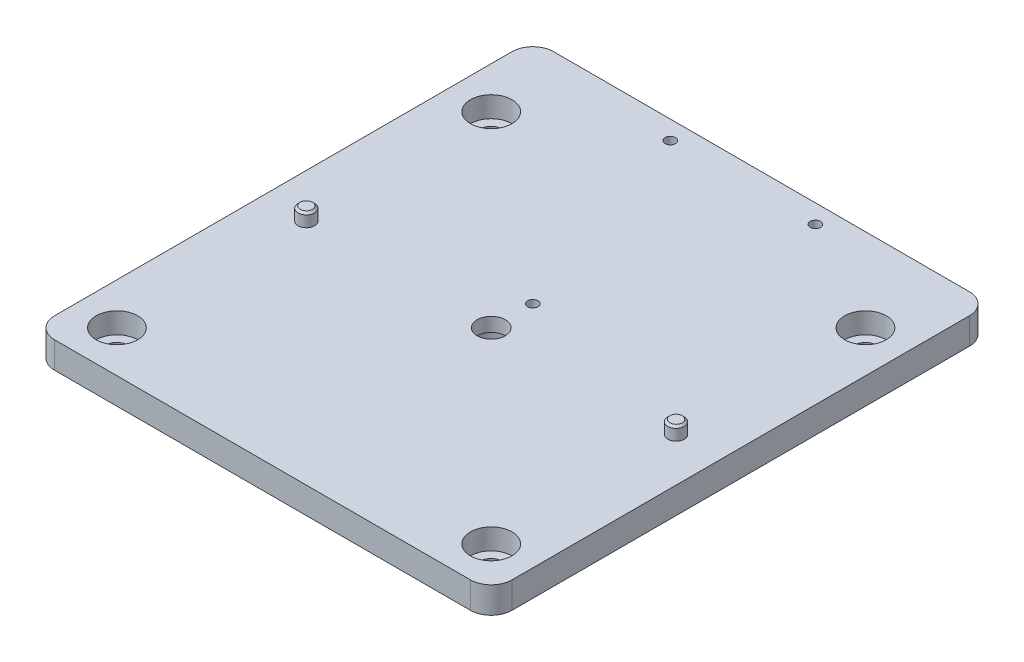
ISO-10303-21;
HEADER;
FILE_DESCRIPTION(('STEP AP214'),'2;1');
FILE_NAME('part.step','',(''),(''),'','','');
FILE_SCHEMA(('AUTOMOTIVE_DESIGN { 1 0 10303 214 1 1 1 1 }'));
ENDSEC;
DATA;
#1=APPLICATION_CONTEXT('core data for automotive mechanical design processes');
#2=APPLICATION_PROTOCOL_DEFINITION('international standard','automotive_design',2000,#1);
#3=PRODUCT_CONTEXT('',#1,'mechanical');
#4=PRODUCT('Part','Part','',(#3));
#5=PRODUCT_RELATED_PRODUCT_CATEGORY('part','',(#4));
#6=PRODUCT_DEFINITION_FORMATION('','',#4);
#7=PRODUCT_DEFINITION_CONTEXT('part definition',#1,'design');
#8=PRODUCT_DEFINITION('design','',#6,#7);
#9=PRODUCT_DEFINITION_SHAPE('','',#8);
#10=(LENGTH_UNIT() NAMED_UNIT(*) SI_UNIT(.MILLI.,.METRE.));
#11=(NAMED_UNIT(*) PLANE_ANGLE_UNIT() SI_UNIT($,.RADIAN.));
#12=(NAMED_UNIT(*) SI_UNIT($,.STERADIAN.) SOLID_ANGLE_UNIT());
#13=UNCERTAINTY_MEASURE_WITH_UNIT(LENGTH_MEASURE(1.E-05),#10,'distance_accuracy_value','');
#14=(GEOMETRIC_REPRESENTATION_CONTEXT(3) GLOBAL_UNCERTAINTY_ASSIGNED_CONTEXT((#13)) GLOBAL_UNIT_ASSIGNED_CONTEXT((#10,
#11,#12)) REPRESENTATION_CONTEXT('',''));
#15=CARTESIAN_POINT('',(0.,0.,0.));
#16=DIRECTION('',(0.,0.,1.));
#17=DIRECTION('',(1.,0.,0.));
#18=AXIS2_PLACEMENT_3D('',#15,#16,#17);
#19=CARTESIAN_POINT('',(-44.45,9.525,0.));
#20=DIRECTION('',(0.,-1.,0.));
#21=DIRECTION('',(0.,0.,-1.));
#22=AXIS2_PLACEMENT_3D('',#19,#20,#21);
#23=CYLINDRICAL_SURFACE('',#22,1.984375);
#24=CARTESIAN_POINT('',(-44.45,0.500000000000006,0.));
#25=DIRECTION('',(0.,1.,0.));
#26=DIRECTION('',(0.,0.,1.));
#27=AXIS2_PLACEMENT_3D('',#24,#25,#26);
#28=CIRCLE('',#27,1.984375);
#29=CARTESIAN_POINT('',(-44.45,0.500000000000006,1.98437500000001));
#30=VERTEX_POINT('',#29);
#31=EDGE_CURVE('E62',#30,#30,#28,.T.);
#32=ORIENTED_EDGE('',*,*,#31,.T.);
#33=EDGE_LOOP('',(#32));
#34=FACE_BOUND('',#33,.T.);
#35=CARTESIAN_POINT('',(-44.45,9.025,0.));
#36=DIRECTION('',(0.,1.,0.));
#37=DIRECTION('',(0.,0.,1.));
#38=AXIS2_PLACEMENT_3D('',#35,#36,#37);
#39=CIRCLE('',#38,1.984375);
#40=CARTESIAN_POINT('',(-44.45,9.025,1.98437500000001));
#41=VERTEX_POINT('',#40);
#42=EDGE_CURVE('E66',#41,#41,#39,.F.);
#43=ORIENTED_EDGE('',*,*,#42,.T.);
#44=EDGE_LOOP('',(#43));
#45=FACE_BOUND('',#44,.T.);
#46=ADVANCED_FACE('F51',(#34,#45),#23,.T.);
#47=CARTESIAN_POINT('',(-44.45,9.525,0.));
#48=DIRECTION('',(0.,1.,0.));
#49=DIRECTION('',(0.,0.,1.));
#50=AXIS2_PLACEMENT_3D('',#47,#48,#49);
#51=PLANE('',#50);
#52=CARTESIAN_POINT('',(-44.45,9.525,0.));
#53=DIRECTION('',(0.,1.,0.));
#54=DIRECTION('',(0.,0.,1.));
#55=AXIS2_PLACEMENT_3D('',#52,#53,#54);
#56=CIRCLE('',#55,1.484375);
#57=CARTESIAN_POINT('',(-44.45,9.525,1.48437500000001));
#58=VERTEX_POINT('',#57);
#59=EDGE_CURVE('E11',#58,#58,#56,.T.);
#60=ORIENTED_EDGE('',*,*,#59,.T.);
#61=EDGE_LOOP('',(#60));
#62=FACE_BOUND('',#61,.T.);
#63=ADVANCED_FACE('F82',(#62),#51,.T.);
#64=CARTESIAN_POINT('',(-44.45,0.,0.));
#65=DIRECTION('',(0.,1.,0.));
#66=DIRECTION('',(0.,0.,1.));
#67=AXIS2_PLACEMENT_3D('',#64,#65,#66);
#68=PLANE('',#67);
#69=CARTESIAN_POINT('',(-44.45,0.,0.));
#70=DIRECTION('',(0.,1.,0.));
#71=DIRECTION('',(0.,0.,1.));
#72=AXIS2_PLACEMENT_3D('',#69,#70,#71);
#73=CIRCLE('',#72,1.48437499999999);
#74=CARTESIAN_POINT('',(-44.45,0.,1.484375));
#75=VERTEX_POINT('',#74);
#76=EDGE_CURVE('E58',#75,#75,#73,.F.);
#77=ORIENTED_EDGE('',*,*,#76,.T.);
#78=EDGE_LOOP('',(#77));
#79=FACE_BOUND('',#78,.T.);
#80=ADVANCED_FACE('F79',(#79),#68,.F.);
#81=CARTESIAN_POINT('',(-44.45,0.500000000000006,0.));
#82=DIRECTION('',(0.,1.,0.));
#83=DIRECTION('',(0.,0.,1.));
#84=AXIS2_PLACEMENT_3D('',#81,#82,#83);
#85=CONICAL_SURFACE('',#84,1.984375,0.785398163397449);
#86=ORIENTED_EDGE('',*,*,#76,.F.);
#87=EDGE_LOOP('',(#86));
#88=FACE_BOUND('',#87,.T.);
#89=ORIENTED_EDGE('',*,*,#31,.F.);
#90=EDGE_LOOP('',(#89));
#91=FACE_BOUND('',#90,.T.);
#92=ADVANCED_FACE('F75',(#88,#91),#85,.T.);
#93=CARTESIAN_POINT('',(-44.45,9.525,0.));
#94=DIRECTION('',(0.,-1.,0.));
#95=DIRECTION('',(0.,0.,-1.));
#96=AXIS2_PLACEMENT_3D('',#93,#94,#95);
#97=CONICAL_SURFACE('',#96,1.484375,0.785398163397446);
#98=ORIENTED_EDGE('',*,*,#42,.F.);
#99=EDGE_LOOP('',(#98));
#100=FACE_BOUND('',#99,.T.);
#101=ORIENTED_EDGE('',*,*,#59,.F.);
#102=EDGE_LOOP('',(#101));
#103=FACE_BOUND('',#102,.T.);
#104=ADVANCED_FACE('F53',(#100,#103),#97,.T.);
#105=CLOSED_SHELL('',(#46,#63,#80,#92,#104));
#106=MANIFOLD_SOLID_BREP('B2',#105);
#107=CARTESIAN_POINT('',(44.45,9.525,0.));
#108=DIRECTION('',(0.,-1.,0.));
#109=DIRECTION('',(0.,0.,-1.));
#110=AXIS2_PLACEMENT_3D('',#107,#108,#109);
#111=CYLINDRICAL_SURFACE('',#110,1.984375);
#112=CARTESIAN_POINT('',(44.45,0.500000000000006,0.));
#113=DIRECTION('',(0.,1.,0.));
#114=DIRECTION('',(0.,0.,1.));
#115=AXIS2_PLACEMENT_3D('',#112,#113,#114);
#116=CIRCLE('',#115,1.984375);
#117=CARTESIAN_POINT('',(44.45,0.500000000000006,1.984375));
#118=VERTEX_POINT('',#117);
#119=EDGE_CURVE('E141',#118,#118,#116,.T.);
#120=ORIENTED_EDGE('',*,*,#119,.T.);
#121=EDGE_LOOP('',(#120));
#122=FACE_BOUND('',#121,.T.);
#123=CARTESIAN_POINT('',(44.45,9.025,0.));
#124=DIRECTION('',(0.,1.,0.));
#125=DIRECTION('',(0.,0.,1.));
#126=AXIS2_PLACEMENT_3D('',#123,#124,#125);
#127=CIRCLE('',#126,1.984375);
#128=CARTESIAN_POINT('',(44.45,9.025,1.984375));
#129=VERTEX_POINT('',#128);
#130=EDGE_CURVE('E145',#129,#129,#127,.F.);
#131=ORIENTED_EDGE('',*,*,#130,.T.);
#132=EDGE_LOOP('',(#131));
#133=FACE_BOUND('',#132,.T.);
#134=ADVANCED_FACE('F130',(#122,#133),#111,.T.);
#135=CARTESIAN_POINT('',(44.45,9.525,0.));
#136=DIRECTION('',(0.,1.,0.));
#137=DIRECTION('',(0.,0.,1.));
#138=AXIS2_PLACEMENT_3D('',#135,#136,#137);
#139=PLANE('',#138);
#140=CARTESIAN_POINT('',(44.45,9.525,0.));
#141=DIRECTION('',(0.,1.,0.));
#142=DIRECTION('',(0.,0.,1.));
#143=AXIS2_PLACEMENT_3D('',#140,#141,#142);
#144=CIRCLE('',#143,1.484375);
#145=CARTESIAN_POINT('',(44.45,9.525,1.484375));
#146=VERTEX_POINT('',#145);
#147=EDGE_CURVE('E50',#146,#146,#144,.T.);
#148=ORIENTED_EDGE('',*,*,#147,.T.);
#149=EDGE_LOOP('',(#148));
#150=FACE_BOUND('',#149,.T.);
#151=ADVANCED_FACE('F161',(#150),#139,.T.);
#152=CARTESIAN_POINT('',(44.45,0.,0.));
#153=DIRECTION('',(0.,1.,0.));
#154=DIRECTION('',(0.,0.,1.));
#155=AXIS2_PLACEMENT_3D('',#152,#153,#154);
#156=PLANE('',#155);
#157=CARTESIAN_POINT('',(44.45,0.,0.));
#158=DIRECTION('',(0.,1.,0.));
#159=DIRECTION('',(0.,0.,1.));
#160=AXIS2_PLACEMENT_3D('',#157,#158,#159);
#161=CIRCLE('',#160,1.48437499999999);
#162=CARTESIAN_POINT('',(44.45,0.,1.48437499999999));
#163=VERTEX_POINT('',#162);
#164=EDGE_CURVE('E137',#163,#163,#161,.F.);
#165=ORIENTED_EDGE('',*,*,#164,.T.);
#166=EDGE_LOOP('',(#165));
#167=FACE_BOUND('',#166,.T.);
#168=ADVANCED_FACE('F158',(#167),#156,.F.);
#169=CARTESIAN_POINT('',(44.45,0.500000000000006,0.));
#170=DIRECTION('',(0.,1.,0.));
#171=DIRECTION('',(0.,0.,1.));
#172=AXIS2_PLACEMENT_3D('',#169,#170,#171);
#173=CONICAL_SURFACE('',#172,1.984375,0.785398163397449);
#174=ORIENTED_EDGE('',*,*,#164,.F.);
#175=EDGE_LOOP('',(#174));
#176=FACE_BOUND('',#175,.T.);
#177=ORIENTED_EDGE('',*,*,#119,.F.);
#178=EDGE_LOOP('',(#177));
#179=FACE_BOUND('',#178,.T.);
#180=ADVANCED_FACE('F154',(#176,#179),#173,.T.);
#181=CARTESIAN_POINT('',(44.45,9.525,0.));
#182=DIRECTION('',(0.,-1.,0.));
#183=DIRECTION('',(0.,0.,-1.));
#184=AXIS2_PLACEMENT_3D('',#181,#182,#183);
#185=CONICAL_SURFACE('',#184,1.484375,0.785398163397446);
#186=ORIENTED_EDGE('',*,*,#130,.F.);
#187=EDGE_LOOP('',(#186));
#188=FACE_BOUND('',#187,.T.);
#189=ORIENTED_EDGE('',*,*,#147,.F.);
#190=EDGE_LOOP('',(#189));
#191=FACE_BOUND('',#190,.T.);
#192=ADVANCED_FACE('F132',(#188,#191),#185,.T.);
#193=CLOSED_SHELL('',(#134,#151,#168,#180,#192));
#194=MANIFOLD_SOLID_BREP('B6',#193);
#195=CARTESIAN_POINT('',(-50.,6.35,50.));
#196=DIRECTION('',(0.,-1.,0.));
#197=DIRECTION('',(0.,0.,-1.));
#198=AXIS2_PLACEMENT_3D('',#195,#196,#197);
#199=CYLINDRICAL_SURFACE('',#198,5.);
#200=CARTESIAN_POINT('',(-50.,0.,50.));
#201=DIRECTION('',(0.,1.,0.));
#202=DIRECTION('',(0.,0.,1.));
#203=AXIS2_PLACEMENT_3D('',#200,#201,#202);
#204=CIRCLE('',#203,5.);
#205=CARTESIAN_POINT('',(-55.,0.,50.));
#206=VERTEX_POINT('',#205);
#207=CARTESIAN_POINT('',(-50.,0.,55.));
#208=VERTEX_POINT('',#207);
#209=EDGE_CURVE('E293',#206,#208,#204,.T.);
#210=ORIENTED_EDGE('',*,*,#209,.T.);
#211=DIRECTION('',(0.,-1.,0.));
#212=VECTOR('',#211,1.);
#213=CARTESIAN_POINT('',(-50.,6.35,55.));
#214=LINE('',#213,#212);
#215=CARTESIAN_POINT('',(-50.,6.35,55.));
#216=VERTEX_POINT('',#215);
#217=EDGE_CURVE('E272',#216,#208,#214,.T.);
#218=ORIENTED_EDGE('',*,*,#217,.F.);
#219=CARTESIAN_POINT('',(-50.,6.35,50.));
#220=DIRECTION('',(0.,1.,0.));
#221=DIRECTION('',(0.,0.,1.));
#222=AXIS2_PLACEMENT_3D('',#219,#220,#221);
#223=CIRCLE('',#222,5.);
#224=CARTESIAN_POINT('',(-55.,6.35,50.));
#225=VERTEX_POINT('',#224);
#226=EDGE_CURVE('E280',#225,#216,#223,.T.);
#227=ORIENTED_EDGE('',*,*,#226,.F.);
#228=DIRECTION('',(0.,-1.,0.));
#229=VECTOR('',#228,1.);
#230=CARTESIAN_POINT('',(-55.,6.35,50.));
#231=LINE('',#230,#229);
#232=EDGE_CURVE('E349',#225,#206,#231,.T.);
#233=ORIENTED_EDGE('',*,*,#232,.T.);
#234=EDGE_LOOP('',(#210,#218,#227,#233));
#235=FACE_BOUND('',#234,.T.);
#236=ADVANCED_FACE('F200',(#235),#199,.T.);
#237=CARTESIAN_POINT('',(-50.,6.35,55.));
#238=DIRECTION('',(0.,0.,-1.));
#239=DIRECTION('',(-1.,0.,0.));
#240=AXIS2_PLACEMENT_3D('',#237,#238,#239);
#241=PLANE('',#240);
#242=DIRECTION('',(1.,0.,0.));
#243=VECTOR('',#242,1.);
#244=CARTESIAN_POINT('',(-50.,0.,55.));
#245=LINE('',#244,#243);
#246=CARTESIAN_POINT('',(50.,0.,55.));
#247=VERTEX_POINT('',#246);
#248=EDGE_CURVE('E358',#208,#247,#245,.T.);
#249=ORIENTED_EDGE('',*,*,#248,.T.);
#250=DIRECTION('',(0.,-1.,0.));
#251=VECTOR('',#250,1.);
#252=CARTESIAN_POINT('',(50.,6.35,55.));
#253=LINE('',#252,#251);
#254=CARTESIAN_POINT('',(50.,6.35,55.));
#255=VERTEX_POINT('',#254);
#256=EDGE_CURVE('E275',#255,#247,#253,.T.);
#257=ORIENTED_EDGE('',*,*,#256,.F.);
#258=DIRECTION('',(1.,0.,0.));
#259=VECTOR('',#258,1.);
#260=CARTESIAN_POINT('',(-50.,6.35,55.));
#261=LINE('',#260,#259);
#262=EDGE_CURVE('E268',#216,#255,#261,.T.);
#263=ORIENTED_EDGE('',*,*,#262,.F.);
#264=ORIENTED_EDGE('',*,*,#217,.T.);
#265=EDGE_LOOP('',(#249,#257,#263,#264));
#266=FACE_BOUND('',#265,.T.);
#267=ADVANCED_FACE('F270',(#266),#241,.F.);
#268=CARTESIAN_POINT('',(50.,6.35,50.));
#269=DIRECTION('',(0.,-1.,0.));
#270=DIRECTION('',(0.,0.,-1.));
#271=AXIS2_PLACEMENT_3D('',#268,#269,#270);
#272=CYLINDRICAL_SURFACE('',#271,5.);
#273=CARTESIAN_POINT('',(50.,0.,50.));
#274=DIRECTION('',(0.,1.,0.));
#275=DIRECTION('',(0.,0.,1.));
#276=AXIS2_PLACEMENT_3D('',#273,#274,#275);
#277=CIRCLE('',#276,5.);
#278=CARTESIAN_POINT('',(55.,0.,50.));
#279=VERTEX_POINT('',#278);
#280=EDGE_CURVE('E362',#247,#279,#277,.T.);
#281=ORIENTED_EDGE('',*,*,#280,.T.);
#282=DIRECTION('',(0.,-1.,0.));
#283=VECTOR('',#282,1.);
#284=CARTESIAN_POINT('',(55.,6.35,50.));
#285=LINE('',#284,#283);
#286=CARTESIAN_POINT('',(55.,6.35,50.));
#287=VERTEX_POINT('',#286);
#288=EDGE_CURVE('E302',#287,#279,#285,.T.);
#289=ORIENTED_EDGE('',*,*,#288,.F.);
#290=CARTESIAN_POINT('',(50.,6.35,50.));
#291=DIRECTION('',(0.,1.,0.));
#292=DIRECTION('',(0.,0.,1.));
#293=AXIS2_PLACEMENT_3D('',#290,#291,#292);
#294=CIRCLE('',#293,5.);
#295=EDGE_CURVE('E279',#255,#287,#294,.T.);
#296=ORIENTED_EDGE('',*,*,#295,.F.);
#297=ORIENTED_EDGE('',*,*,#256,.T.);
#298=EDGE_LOOP('',(#281,#289,#296,#297));
#299=FACE_BOUND('',#298,.T.);
#300=ADVANCED_FACE('F374',(#299),#272,.T.);
#301=CARTESIAN_POINT('',(55.,6.35,50.));
#302=DIRECTION('',(-1.,0.,0.));
#303=DIRECTION('',(0.,0.,1.));
#304=AXIS2_PLACEMENT_3D('',#301,#302,#303);
#305=PLANE('',#304);
#306=DIRECTION('',(0.,0.,-1.));
#307=VECTOR('',#306,1.);
#308=CARTESIAN_POINT('',(55.,0.,50.));
#309=LINE('',#308,#307);
#310=CARTESIAN_POINT('',(55.,0.,-60.));
#311=VERTEX_POINT('',#310);
#312=EDGE_CURVE('E364',#279,#311,#309,.T.);
#313=ORIENTED_EDGE('',*,*,#312,.T.);
#314=DIRECTION('',(0.,-1.,0.));
#315=VECTOR('',#314,1.);
#316=CARTESIAN_POINT('',(55.,6.35,-60.));
#317=LINE('',#316,#315);
#318=CARTESIAN_POINT('',(55.,6.35,-60.));
#319=VERTEX_POINT('',#318);
#320=EDGE_CURVE('E128',#311,#319,#317,.F.);
#321=ORIENTED_EDGE('',*,*,#320,.T.);
#322=DIRECTION('',(0.,0.,-1.));
#323=VECTOR('',#322,1.);
#324=CARTESIAN_POINT('',(55.,6.35,50.));
#325=LINE('',#324,#323);
#326=EDGE_CURVE('E350',#287,#319,#325,.T.);
#327=ORIENTED_EDGE('',*,*,#326,.F.);
#328=ORIENTED_EDGE('',*,*,#288,.T.);
#329=EDGE_LOOP('',(#313,#321,#327,#328));
#330=FACE_BOUND('',#329,.T.);
#331=ADVANCED_FACE('F370',(#330),#305,.F.);
#332=CARTESIAN_POINT('',(-55.,6.35,50.));
#333=DIRECTION('',(1.,0.,0.));
#334=DIRECTION('',(0.,0.,-1.));
#335=AXIS2_PLACEMENT_3D('',#332,#333,#334);
#336=PLANE('',#335);
#337=DIRECTION('',(0.,0.,1.));
#338=VECTOR('',#337,1.);
#339=CARTESIAN_POINT('',(-55.,6.35,50.));
#340=LINE('',#339,#338);
#341=CARTESIAN_POINT('',(-55.,6.35,-60.));
#342=VERTEX_POINT('',#341);
#343=EDGE_CURVE('E285',#342,#225,#340,.T.);
#344=ORIENTED_EDGE('',*,*,#343,.F.);
#345=DIRECTION('',(0.,1.,0.));
#346=VECTOR('',#345,1.);
#347=CARTESIAN_POINT('',(-55.,6.35,-60.));
#348=LINE('',#347,#346);
#349=CARTESIAN_POINT('',(-55.,0.,-60.));
#350=VERTEX_POINT('',#349);
#351=EDGE_CURVE('E223',#342,#350,#348,.F.);
#352=ORIENTED_EDGE('',*,*,#351,.T.);
#353=DIRECTION('',(0.,0.,1.));
#354=VECTOR('',#353,1.);
#355=CARTESIAN_POINT('',(-55.,0.,50.));
#356=LINE('',#355,#354);
#357=EDGE_CURVE('E290',#350,#206,#356,.T.);
#358=ORIENTED_EDGE('',*,*,#357,.T.);
#359=ORIENTED_EDGE('',*,*,#232,.F.);
#360=EDGE_LOOP('',(#344,#352,#358,#359));
#361=FACE_BOUND('',#360,.T.);
#362=ADVANCED_FACE('F348',(#361),#336,.F.);
#363=CARTESIAN_POINT('',(-50.,6.35,50.));
#364=DIRECTION('',(0.,1.,0.));
#365=DIRECTION('',(0.,0.,1.));
#366=AXIS2_PLACEMENT_3D('',#363,#364,#365);
#367=PLANE('',#366);
#368=CARTESIAN_POINT('',(17.45,6.35,-60.4999999999998));
#369=DIRECTION('',(0.,-1.,0.));
#370=DIRECTION('',(0.,0.,-1.));
#371=AXIS2_PLACEMENT_3D('',#368,#369,#370);
#372=CIRCLE('',#371,1.25);
#373=CARTESIAN_POINT('',(17.45,6.35,-61.7499999999998));
#374=VERTEX_POINT('',#373);
#375=EDGE_CURVE('E441',#374,#374,#372,.T.);
#376=ORIENTED_EDGE('',*,*,#375,.T.);
#377=EDGE_LOOP('',(#376));
#378=FACE_BOUND('',#377,.T.);
#379=CARTESIAN_POINT('',(-17.45,6.35,-60.4999999999998));
#380=DIRECTION('',(0.,-1.,0.));
#381=DIRECTION('',(0.,0.,-1.));
#382=AXIS2_PLACEMENT_3D('',#379,#380,#381);
#383=CIRCLE('',#382,1.25);
#384=CARTESIAN_POINT('',(-17.45,6.35,-61.7499999999998));
#385=VERTEX_POINT('',#384);
#386=EDGE_CURVE('E435',#385,#385,#383,.T.);
#387=ORIENTED_EDGE('',*,*,#386,.T.);
#388=EDGE_LOOP('',(#387));
#389=FACE_BOUND('',#388,.T.);
#390=CARTESIAN_POINT('',(0.,6.35,-10.));
#391=DIRECTION('',(0.,-1.,0.));
#392=DIRECTION('',(0.,0.,-1.));
#393=AXIS2_PLACEMENT_3D('',#390,#391,#392);
#394=CIRCLE('',#393,1.25);
#395=CARTESIAN_POINT('',(0.,6.35,-11.25));
#396=VERTEX_POINT('',#395);
#397=EDGE_CURVE('E429',#396,#396,#394,.T.);
#398=ORIENTED_EDGE('',*,*,#397,.T.);
#399=EDGE_LOOP('',(#398));
#400=FACE_BOUND('',#399,.T.);
#401=CARTESIAN_POINT('',(-44.45,6.35,0.));
#402=DIRECTION('',(0.,1.,0.));
#403=DIRECTION('',(0.,0.,1.));
#404=AXIS2_PLACEMENT_3D('',#401,#402,#403);
#405=CIRCLE('',#404,1.984375);
#406=CARTESIAN_POINT('',(-44.45,6.35,1.98437500000001));
#407=VERTEX_POINT('',#406);
#408=EDGE_CURVE('E344',#407,#407,#405,.T.);
#409=ORIENTED_EDGE('',*,*,#408,.F.);
#410=EDGE_LOOP('',(#409));
#411=FACE_BOUND('',#410,.T.);
#412=CARTESIAN_POINT('',(44.45,6.35,0.));
#413=DIRECTION('',(0.,1.,0.));
#414=DIRECTION('',(0.,0.,1.));
#415=AXIS2_PLACEMENT_3D('',#412,#413,#414);
#416=CIRCLE('',#415,1.984375);
#417=CARTESIAN_POINT('',(44.45,6.35,1.984375));
#418=VERTEX_POINT('',#417);
#419=EDGE_CURVE('E420',#418,#418,#416,.T.);
#420=ORIENTED_EDGE('',*,*,#419,.F.);
#421=EDGE_LOOP('',(#420));
#422=FACE_BOUND('',#421,.T.);
#423=CARTESIAN_POINT('',(45.,6.35,-45.));
#424=DIRECTION('',(0.,1.,0.));
#425=DIRECTION('',(0.,0.,1.));
#426=AXIS2_PLACEMENT_3D('',#423,#424,#425);
#427=CIRCLE('',#426,5.);
#428=CARTESIAN_POINT('',(45.,6.35,-40.));
#429=VERTEX_POINT('',#428);
#430=EDGE_CURVE('E414',#429,#429,#427,.T.);
#431=ORIENTED_EDGE('',*,*,#430,.F.);
#432=EDGE_LOOP('',(#431));
#433=FACE_BOUND('',#432,.T.);
#434=CARTESIAN_POINT('',(45.,6.35,45.));
#435=DIRECTION('',(0.,1.,0.));
#436=DIRECTION('',(0.,0.,1.));
#437=AXIS2_PLACEMENT_3D('',#434,#435,#436);
#438=CIRCLE('',#437,5.);
#439=CARTESIAN_POINT('',(45.,6.35,50.));
#440=VERTEX_POINT('',#439);
#441=EDGE_CURVE('E324',#440,#440,#438,.T.);
#442=ORIENTED_EDGE('',*,*,#441,.F.);
#443=EDGE_LOOP('',(#442));
#444=FACE_BOUND('',#443,.T.);
#445=CARTESIAN_POINT('',(-45.,6.35,45.));
#446=DIRECTION('',(0.,1.,0.));
#447=DIRECTION('',(0.,0.,1.));
#448=AXIS2_PLACEMENT_3D('',#445,#446,#447);
#449=CIRCLE('',#448,5.);
#450=CARTESIAN_POINT('',(-45.,6.35,50.));
#451=VERTEX_POINT('',#450);
#452=EDGE_CURVE('E320',#451,#451,#449,.T.);
#453=ORIENTED_EDGE('',*,*,#452,.F.);
#454=EDGE_LOOP('',(#453));
#455=FACE_BOUND('',#454,.T.);
#456=CARTESIAN_POINT('',(-45.,6.35,-45.));
#457=DIRECTION('',(0.,1.,0.));
#458=DIRECTION('',(0.,0.,1.));
#459=AXIS2_PLACEMENT_3D('',#456,#457,#458);
#460=CIRCLE('',#459,5.);
#461=CARTESIAN_POINT('',(-45.,6.35,-40.));
#462=VERTEX_POINT('',#461);
#463=EDGE_CURVE('E315',#462,#462,#460,.T.);
#464=ORIENTED_EDGE('',*,*,#463,.F.);
#465=EDGE_LOOP('',(#464));
#466=FACE_BOUND('',#465,.T.);
#467=CARTESIAN_POINT('',(0.,6.35,0.));
#468=DIRECTION('',(0.,-1.,0.));
#469=DIRECTION('',(0.,0.,-1.));
#470=AXIS2_PLACEMENT_3D('',#467,#468,#469);
#471=CIRCLE('',#470,3.3782);
#472=CARTESIAN_POINT('',(0.,6.35,-3.3782));
#473=VERTEX_POINT('',#472);
#474=EDGE_CURVE('E359',#473,#473,#471,.T.);
#475=ORIENTED_EDGE('',*,*,#474,.T.);
#476=EDGE_LOOP('',(#475));
#477=FACE_BOUND('',#476,.T.);
#478=DIRECTION('',(1.,0.,0.));
#479=VECTOR('',#478,1.);
#480=CARTESIAN_POINT('',(55.,6.35,-65.));
#481=LINE('',#480,#479);
#482=CARTESIAN_POINT('',(-50.,6.35,-65.));
#483=VERTEX_POINT('',#482);
#484=CARTESIAN_POINT('',(50.,6.35,-65.));
#485=VERTEX_POINT('',#484);
#486=EDGE_CURVE('E345',#483,#485,#481,.T.);
#487=ORIENTED_EDGE('',*,*,#486,.F.);
#488=CARTESIAN_POINT('',(-50.,6.35,-60.));
#489=DIRECTION('',(0.,1.,0.));
#490=DIRECTION('',(0.,0.,1.));
#491=AXIS2_PLACEMENT_3D('',#488,#489,#490);
#492=CIRCLE('',#491,5.);
#493=EDGE_CURVE('E331',#483,#342,#492,.T.);
#494=ORIENTED_EDGE('',*,*,#493,.T.);
#495=ORIENTED_EDGE('',*,*,#343,.T.);
#496=ORIENTED_EDGE('',*,*,#226,.T.);
#497=ORIENTED_EDGE('',*,*,#262,.T.);
#498=ORIENTED_EDGE('',*,*,#295,.T.);
#499=ORIENTED_EDGE('',*,*,#326,.T.);
#500=CARTESIAN_POINT('',(50.,6.35,-60.));
#501=DIRECTION('',(0.,1.,0.));
#502=DIRECTION('',(0.,0.,1.));
#503=AXIS2_PLACEMENT_3D('',#500,#501,#502);
#504=CIRCLE('',#503,5.);
#505=EDGE_CURVE('E329',#319,#485,#504,.T.);
#506=ORIENTED_EDGE('',*,*,#505,.T.);
#507=EDGE_LOOP('',(#487,#494,#495,#496,#497,#498,#499,#506));
#508=FACE_BOUND('',#507,.T.);
#509=ADVANCED_FACE('F284',(#378,#389,#400,#411,#422,#433,#444,#455,#466,#477,#508),#367,.T.);
#510=CARTESIAN_POINT('',(-50.,0.,50.));
#511=DIRECTION('',(0.,1.,0.));
#512=DIRECTION('',(0.,0.,1.));
#513=AXIS2_PLACEMENT_3D('',#510,#511,#512);
#514=PLANE('',#513);
#515=CARTESIAN_POINT('',(17.45,0.,-60.4999999999998));
#516=DIRECTION('',(0.,-1.,0.));
#517=DIRECTION('',(0.,0.,-1.));
#518=AXIS2_PLACEMENT_3D('',#515,#516,#517);
#519=CIRCLE('',#518,1.25);
#520=CARTESIAN_POINT('',(17.45,0.,-61.7499999999998));
#521=VERTEX_POINT('',#520);
#522=EDGE_CURVE('E444',#521,#521,#519,.T.);
#523=ORIENTED_EDGE('',*,*,#522,.F.);
#524=EDGE_LOOP('',(#523));
#525=FACE_BOUND('',#524,.T.);
#526=CARTESIAN_POINT('',(-17.45,0.,-60.4999999999998));
#527=DIRECTION('',(0.,-1.,0.));
#528=DIRECTION('',(0.,0.,-1.));
#529=AXIS2_PLACEMENT_3D('',#526,#527,#528);
#530=CIRCLE('',#529,1.25);
#531=CARTESIAN_POINT('',(-17.45,0.,-61.7499999999998));
#532=VERTEX_POINT('',#531);
#533=EDGE_CURVE('E438',#532,#532,#530,.T.);
#534=ORIENTED_EDGE('',*,*,#533,.F.);
#535=EDGE_LOOP('',(#534));
#536=FACE_BOUND('',#535,.T.);
#537=CARTESIAN_POINT('',(0.,0.,-10.));
#538=DIRECTION('',(0.,-1.,0.));
#539=DIRECTION('',(0.,0.,-1.));
#540=AXIS2_PLACEMENT_3D('',#537,#538,#539);
#541=CIRCLE('',#540,1.25);
#542=CARTESIAN_POINT('',(0.,0.,-11.25));
#543=VERTEX_POINT('',#542);
#544=EDGE_CURVE('E432',#543,#543,#541,.T.);
#545=ORIENTED_EDGE('',*,*,#544,.F.);
#546=EDGE_LOOP('',(#545));
#547=FACE_BOUND('',#546,.T.);
#548=CARTESIAN_POINT('',(-44.45,0.,0.));
#549=DIRECTION('',(0.,1.,0.));
#550=DIRECTION('',(0.,0.,1.));
#551=AXIS2_PLACEMENT_3D('',#548,#549,#550);
#552=CIRCLE('',#551,1.984375);
#553=CARTESIAN_POINT('',(-44.45,0.,1.98437500000001));
#554=VERTEX_POINT('',#553);
#555=EDGE_CURVE('E423',#554,#554,#552,.T.);
#556=ORIENTED_EDGE('',*,*,#555,.T.);
#557=EDGE_LOOP('',(#556));
#558=FACE_BOUND('',#557,.T.);
#559=CARTESIAN_POINT('',(44.45,0.,0.));
#560=DIRECTION('',(0.,1.,0.));
#561=DIRECTION('',(0.,0.,1.));
#562=AXIS2_PLACEMENT_3D('',#559,#560,#561);
#563=CIRCLE('',#562,1.984375);
#564=CARTESIAN_POINT('',(44.45,0.,1.984375));
#565=VERTEX_POINT('',#564);
#566=EDGE_CURVE('E417',#565,#565,#563,.T.);
#567=ORIENTED_EDGE('',*,*,#566,.T.);
#568=EDGE_LOOP('',(#567));
#569=FACE_BOUND('',#568,.T.);
#570=CARTESIAN_POINT('',(45.,0.,-45.));
#571=DIRECTION('',(0.,1.,0.));
#572=DIRECTION('',(0.,0.,1.));
#573=AXIS2_PLACEMENT_3D('',#570,#571,#572);
#574=CIRCLE('',#573,2.75);
#575=CARTESIAN_POINT('',(45.,0.,-42.25));
#576=VERTEX_POINT('',#575);
#577=EDGE_CURVE('E322',#576,#576,#574,.T.);
#578=ORIENTED_EDGE('',*,*,#577,.T.);
#579=EDGE_LOOP('',(#578));
#580=FACE_BOUND('',#579,.T.);
#581=CARTESIAN_POINT('',(45.,0.,45.));
#582=DIRECTION('',(0.,1.,0.));
#583=DIRECTION('',(0.,0.,1.));
#584=AXIS2_PLACEMENT_3D('',#581,#582,#583);
#585=CIRCLE('',#584,2.75);
#586=CARTESIAN_POINT('',(45.,0.,47.75));
#587=VERTEX_POINT('',#586);
#588=EDGE_CURVE('E317',#587,#587,#585,.T.);
#589=ORIENTED_EDGE('',*,*,#588,.T.);
#590=EDGE_LOOP('',(#589));
#591=FACE_BOUND('',#590,.T.);
#592=CARTESIAN_POINT('',(-45.,0.,45.));
#593=DIRECTION('',(0.,1.,0.));
#594=DIRECTION('',(0.,0.,1.));
#595=AXIS2_PLACEMENT_3D('',#592,#593,#594);
#596=CIRCLE('',#595,2.75);
#597=CARTESIAN_POINT('',(-45.,0.,47.75));
#598=VERTEX_POINT('',#597);
#599=EDGE_CURVE('E311',#598,#598,#596,.T.);
#600=ORIENTED_EDGE('',*,*,#599,.T.);
#601=EDGE_LOOP('',(#600));
#602=FACE_BOUND('',#601,.T.);
#603=CARTESIAN_POINT('',(-45.,0.,-45.));
#604=DIRECTION('',(0.,1.,0.));
#605=DIRECTION('',(0.,0.,1.));
#606=AXIS2_PLACEMENT_3D('',#603,#604,#605);
#607=CIRCLE('',#606,2.75);
#608=CARTESIAN_POINT('',(-45.,0.,-42.25));
#609=VERTEX_POINT('',#608);
#610=EDGE_CURVE('E306',#609,#609,#607,.T.);
#611=ORIENTED_EDGE('',*,*,#610,.T.);
#612=EDGE_LOOP('',(#611));
#613=FACE_BOUND('',#612,.T.);
#614=CARTESIAN_POINT('',(0.,0.,0.));
#615=DIRECTION('',(0.,-1.,0.));
#616=DIRECTION('',(0.,0.,-1.));
#617=AXIS2_PLACEMENT_3D('',#614,#615,#616);
#618=CIRCLE('',#617,5.55625);
#619=CARTESIAN_POINT('',(0.,0.,-5.55625));
#620=VERTEX_POINT('',#619);
#621=EDGE_CURVE('E309',#620,#620,#618,.T.);
#622=ORIENTED_EDGE('',*,*,#621,.F.);
#623=EDGE_LOOP('',(#622));
#624=FACE_BOUND('',#623,.T.);
#625=ORIENTED_EDGE('',*,*,#357,.F.);
#626=CARTESIAN_POINT('',(-50.,0.,-60.));
#627=DIRECTION('',(0.,1.,0.));
#628=DIRECTION('',(0.,0.,1.));
#629=AXIS2_PLACEMENT_3D('',#626,#627,#628);
#630=CIRCLE('',#629,5.);
#631=CARTESIAN_POINT('',(-50.,0.,-65.));
#632=VERTEX_POINT('',#631);
#633=EDGE_CURVE('E208',#350,#632,#630,.F.);
#634=ORIENTED_EDGE('',*,*,#633,.T.);
#635=DIRECTION('',(-1.,0.,0.));
#636=VECTOR('',#635,1.);
#637=CARTESIAN_POINT('',(55.,0.,-65.));
#638=LINE('',#637,#636);
#639=CARTESIAN_POINT('',(50.,0.,-65.));
#640=VERTEX_POINT('',#639);
#641=EDGE_CURVE('E337',#640,#632,#638,.T.);
#642=ORIENTED_EDGE('',*,*,#641,.F.);
#643=CARTESIAN_POINT('',(50.,0.,-60.));
#644=DIRECTION('',(0.,1.,0.));
#645=DIRECTION('',(0.,0.,1.));
#646=AXIS2_PLACEMENT_3D('',#643,#644,#645);
#647=CIRCLE('',#646,5.);
#648=EDGE_CURVE('E215',#640,#311,#647,.F.);
#649=ORIENTED_EDGE('',*,*,#648,.T.);
#650=ORIENTED_EDGE('',*,*,#312,.F.);
#651=ORIENTED_EDGE('',*,*,#280,.F.);
#652=ORIENTED_EDGE('',*,*,#248,.F.);
#653=ORIENTED_EDGE('',*,*,#209,.F.);
#654=EDGE_LOOP('',(#625,#634,#642,#649,#650,#651,#652,#653));
#655=FACE_BOUND('',#654,.T.);
#656=ADVANCED_FACE('F336',(#525,#536,#547,#558,#569,#580,#591,#602,#613,#624,#655),#514,.F.);
#657=CARTESIAN_POINT('',(0.,0.,0.));
#658=DIRECTION('',(0.,-1.,0.));
#659=DIRECTION('',(0.,0.,-1.));
#660=AXIS2_PLACEMENT_3D('',#657,#658,#659);
#661=CYLINDRICAL_SURFACE('',#660,3.3782);
#662=ORIENTED_EDGE('',*,*,#474,.F.);
#663=EDGE_LOOP('',(#662));
#664=FACE_BOUND('',#663,.T.);
#665=CARTESIAN_POINT('',(0.,2.999994,0.));
#666=DIRECTION('',(0.,-1.,0.));
#667=DIRECTION('',(0.,0.,-1.));
#668=AXIS2_PLACEMENT_3D('',#665,#666,#667);
#669=CIRCLE('',#668,3.3782);
#670=CARTESIAN_POINT('',(0.,2.999994,-3.3782));
#671=VERTEX_POINT('',#670);
#672=EDGE_CURVE('E378',#671,#671,#669,.T.);
#673=ORIENTED_EDGE('',*,*,#672,.T.);
#674=EDGE_LOOP('',(#673));
#675=FACE_BOUND('',#674,.T.);
#676=ADVANCED_FACE('F452',(#664,#675),#661,.F.);
#677=CARTESIAN_POINT('',(3.3782,2.999994,0.));
#678=DIRECTION('',(0.,1.,0.));
#679=DIRECTION('',(0.,0.,1.));
#680=AXIS2_PLACEMENT_3D('',#677,#678,#679);
#681=PLANE('',#680);
#682=ORIENTED_EDGE('',*,*,#672,.F.);
#683=EDGE_LOOP('',(#682));
#684=FACE_BOUND('',#683,.T.);
#685=CARTESIAN_POINT('',(0.,2.999994,0.));
#686=DIRECTION('',(0.,-1.,0.));
#687=DIRECTION('',(0.,0.,-1.));
#688=AXIS2_PLACEMENT_3D('',#685,#686,#687);
#689=CIRCLE('',#688,5.55625);
#690=CARTESIAN_POINT('',(0.,2.999994,-5.55625));
#691=VERTEX_POINT('',#690);
#692=EDGE_CURVE('E381',#691,#691,#689,.T.);
#693=ORIENTED_EDGE('',*,*,#692,.T.);
#694=EDGE_LOOP('',(#693));
#695=FACE_BOUND('',#694,.T.);
#696=ADVANCED_FACE('F475',(#684,#695),#681,.F.);
#697=CARTESIAN_POINT('',(0.,0.,0.));
#698=DIRECTION('',(0.,-1.,0.));
#699=DIRECTION('',(0.,0.,-1.));
#700=AXIS2_PLACEMENT_3D('',#697,#698,#699);
#701=CYLINDRICAL_SURFACE('',#700,5.55625);
#702=ORIENTED_EDGE('',*,*,#692,.F.);
#703=EDGE_LOOP('',(#702));
#704=FACE_BOUND('',#703,.T.);
#705=ORIENTED_EDGE('',*,*,#621,.T.);
#706=EDGE_LOOP('',(#705));
#707=FACE_BOUND('',#706,.T.);
#708=ADVANCED_FACE('F472',(#704,#707),#701,.F.);
#709=CARTESIAN_POINT('',(-45.,6.35,-45.));
#710=DIRECTION('',(0.,1.,0.));
#711=DIRECTION('',(0.,0.,1.));
#712=AXIS2_PLACEMENT_3D('',#709,#710,#711);
#713=CYLINDRICAL_SURFACE('',#712,2.75);
#714=CARTESIAN_POINT('',(-45.,1.35,-45.));
#715=DIRECTION('',(0.,1.,0.));
#716=DIRECTION('',(0.,0.,1.));
#717=AXIS2_PLACEMENT_3D('',#714,#715,#716);
#718=CIRCLE('',#717,2.75);
#719=CARTESIAN_POINT('',(-45.,1.35,-42.25));
#720=VERTEX_POINT('',#719);
#721=EDGE_CURVE('E310',#720,#720,#718,.T.);
#722=ORIENTED_EDGE('',*,*,#721,.T.);
#723=EDGE_LOOP('',(#722));
#724=FACE_BOUND('',#723,.T.);
#725=ORIENTED_EDGE('',*,*,#610,.F.);
#726=EDGE_LOOP('',(#725));
#727=FACE_BOUND('',#726,.T.);
#728=ADVANCED_FACE('F474',(#724,#727),#713,.F.);
#729=CARTESIAN_POINT('',(-42.25,1.35,-45.));
#730=DIRECTION('',(0.,-1.,0.));
#731=DIRECTION('',(0.,0.,-1.));
#732=AXIS2_PLACEMENT_3D('',#729,#730,#731);
#733=PLANE('',#732);
#734=ORIENTED_EDGE('',*,*,#721,.F.);
#735=EDGE_LOOP('',(#734));
#736=FACE_BOUND('',#735,.T.);
#737=CARTESIAN_POINT('',(-45.,1.35,-45.));
#738=DIRECTION('',(0.,1.,0.));
#739=DIRECTION('',(0.,0.,1.));
#740=AXIS2_PLACEMENT_3D('',#737,#738,#739);
#741=CIRCLE('',#740,5.);
#742=CARTESIAN_POINT('',(-45.,1.35,-40.));
#743=VERTEX_POINT('',#742);
#744=EDGE_CURVE('E388',#743,#743,#741,.T.);
#745=ORIENTED_EDGE('',*,*,#744,.T.);
#746=EDGE_LOOP('',(#745));
#747=FACE_BOUND('',#746,.T.);
#748=ADVANCED_FACE('F482',(#736,#747),#733,.F.);
#749=CARTESIAN_POINT('',(-45.,6.35,-45.));
#750=DIRECTION('',(0.,1.,0.));
#751=DIRECTION('',(0.,0.,1.));
#752=AXIS2_PLACEMENT_3D('',#749,#750,#751);
#753=CYLINDRICAL_SURFACE('',#752,5.);
#754=ORIENTED_EDGE('',*,*,#744,.F.);
#755=EDGE_LOOP('',(#754));
#756=FACE_BOUND('',#755,.T.);
#757=ORIENTED_EDGE('',*,*,#463,.T.);
#758=EDGE_LOOP('',(#757));
#759=FACE_BOUND('',#758,.T.);
#760=ADVANCED_FACE('F551',(#756,#759),#753,.F.);
#761=CARTESIAN_POINT('',(-45.,6.35,45.));
#762=DIRECTION('',(0.,1.,0.));
#763=DIRECTION('',(0.,0.,1.));
#764=AXIS2_PLACEMENT_3D('',#761,#762,#763);
#765=CYLINDRICAL_SURFACE('',#764,2.75);
#766=CARTESIAN_POINT('',(-45.,1.35,45.));
#767=DIRECTION('',(0.,1.,0.));
#768=DIRECTION('',(0.,0.,1.));
#769=AXIS2_PLACEMENT_3D('',#766,#767,#768);
#770=CIRCLE('',#769,2.75);
#771=CARTESIAN_POINT('',(-45.,1.35,47.75));
#772=VERTEX_POINT('',#771);
#773=EDGE_CURVE('E316',#772,#772,#770,.T.);
#774=ORIENTED_EDGE('',*,*,#773,.T.);
#775=EDGE_LOOP('',(#774));
#776=FACE_BOUND('',#775,.T.);
#777=ORIENTED_EDGE('',*,*,#599,.F.);
#778=EDGE_LOOP('',(#777));
#779=FACE_BOUND('',#778,.T.);
#780=ADVANCED_FACE('F547',(#776,#779),#765,.F.);
#781=CARTESIAN_POINT('',(-42.25,1.35,45.));
#782=DIRECTION('',(0.,-1.,0.));
#783=DIRECTION('',(0.,0.,-1.));
#784=AXIS2_PLACEMENT_3D('',#781,#782,#783);
#785=PLANE('',#784);
#786=ORIENTED_EDGE('',*,*,#773,.F.);
#787=EDGE_LOOP('',(#786));
#788=FACE_BOUND('',#787,.T.);
#789=CARTESIAN_POINT('',(-45.,1.35,45.));
#790=DIRECTION('',(0.,1.,0.));
#791=DIRECTION('',(0.,0.,1.));
#792=AXIS2_PLACEMENT_3D('',#789,#790,#791);
#793=CIRCLE('',#792,5.);
#794=CARTESIAN_POINT('',(-45.,1.35,50.));
#795=VERTEX_POINT('',#794);
#796=EDGE_CURVE('E396',#795,#795,#793,.T.);
#797=ORIENTED_EDGE('',*,*,#796,.T.);
#798=EDGE_LOOP('',(#797));
#799=FACE_BOUND('',#798,.T.);
#800=ADVANCED_FACE('F543',(#788,#799),#785,.F.);
#801=CARTESIAN_POINT('',(-45.,6.35,45.));
#802=DIRECTION('',(0.,1.,0.));
#803=DIRECTION('',(0.,0.,1.));
#804=AXIS2_PLACEMENT_3D('',#801,#802,#803);
#805=CYLINDRICAL_SURFACE('',#804,5.);
#806=ORIENTED_EDGE('',*,*,#796,.F.);
#807=EDGE_LOOP('',(#806));
#808=FACE_BOUND('',#807,.T.);
#809=ORIENTED_EDGE('',*,*,#452,.T.);
#810=EDGE_LOOP('',(#809));
#811=FACE_BOUND('',#810,.T.);
#812=ADVANCED_FACE('F539',(#808,#811),#805,.F.);
#813=CARTESIAN_POINT('',(45.,6.35,45.));
#814=DIRECTION('',(0.,1.,0.));
#815=DIRECTION('',(0.,0.,1.));
#816=AXIS2_PLACEMENT_3D('',#813,#814,#815);
#817=CYLINDRICAL_SURFACE('',#816,2.75);
#818=CARTESIAN_POINT('',(45.,1.35,45.));
#819=DIRECTION('',(0.,1.,0.));
#820=DIRECTION('',(0.,0.,1.));
#821=AXIS2_PLACEMENT_3D('',#818,#819,#820);
#822=CIRCLE('',#821,2.75);
#823=CARTESIAN_POINT('',(45.,1.35,47.75));
#824=VERTEX_POINT('',#823);
#825=EDGE_CURVE('E321',#824,#824,#822,.T.);
#826=ORIENTED_EDGE('',*,*,#825,.T.);
#827=EDGE_LOOP('',(#826));
#828=FACE_BOUND('',#827,.T.);
#829=ORIENTED_EDGE('',*,*,#588,.F.);
#830=EDGE_LOOP('',(#829));
#831=FACE_BOUND('',#830,.T.);
#832=ADVANCED_FACE('F535',(#828,#831),#817,.F.);
#833=CARTESIAN_POINT('',(47.75,1.35,45.));
#834=DIRECTION('',(0.,-1.,0.));
#835=DIRECTION('',(0.,0.,-1.));
#836=AXIS2_PLACEMENT_3D('',#833,#834,#835);
#837=PLANE('',#836);
#838=ORIENTED_EDGE('',*,*,#825,.F.);
#839=EDGE_LOOP('',(#838));
#840=FACE_BOUND('',#839,.T.);
#841=CARTESIAN_POINT('',(45.,1.35,45.));
#842=DIRECTION('',(0.,1.,0.));
#843=DIRECTION('',(0.,0.,1.));
#844=AXIS2_PLACEMENT_3D('',#841,#842,#843);
#845=CIRCLE('',#844,5.);
#846=CARTESIAN_POINT('',(45.,1.35,50.));
#847=VERTEX_POINT('',#846);
#848=EDGE_CURVE('E404',#847,#847,#845,.T.);
#849=ORIENTED_EDGE('',*,*,#848,.T.);
#850=EDGE_LOOP('',(#849));
#851=FACE_BOUND('',#850,.T.);
#852=ADVANCED_FACE('F531',(#840,#851),#837,.F.);
#853=CARTESIAN_POINT('',(45.,6.35,45.));
#854=DIRECTION('',(0.,1.,0.));
#855=DIRECTION('',(0.,0.,1.));
#856=AXIS2_PLACEMENT_3D('',#853,#854,#855);
#857=CYLINDRICAL_SURFACE('',#856,5.);
#858=ORIENTED_EDGE('',*,*,#848,.F.);
#859=EDGE_LOOP('',(#858));
#860=FACE_BOUND('',#859,.T.);
#861=ORIENTED_EDGE('',*,*,#441,.T.);
#862=EDGE_LOOP('',(#861));
#863=FACE_BOUND('',#862,.T.);
#864=ADVANCED_FACE('F527',(#860,#863),#857,.F.);
#865=CARTESIAN_POINT('',(45.,6.35,-45.));
#866=DIRECTION('',(0.,1.,0.));
#867=DIRECTION('',(0.,0.,1.));
#868=AXIS2_PLACEMENT_3D('',#865,#866,#867);
#869=CYLINDRICAL_SURFACE('',#868,2.75);
#870=CARTESIAN_POINT('',(45.,1.35,-45.));
#871=DIRECTION('',(0.,1.,0.));
#872=DIRECTION('',(0.,0.,1.));
#873=AXIS2_PLACEMENT_3D('',#870,#871,#872);
#874=CIRCLE('',#873,2.75);
#875=CARTESIAN_POINT('',(45.,1.35,-42.25));
#876=VERTEX_POINT('',#875);
#877=EDGE_CURVE('E325',#876,#876,#874,.T.);
#878=ORIENTED_EDGE('',*,*,#877,.T.);
#879=EDGE_LOOP('',(#878));
#880=FACE_BOUND('',#879,.T.);
#881=ORIENTED_EDGE('',*,*,#577,.F.);
#882=EDGE_LOOP('',(#881));
#883=FACE_BOUND('',#882,.T.);
#884=ADVANCED_FACE('F523',(#880,#883),#869,.F.);
#885=CARTESIAN_POINT('',(47.75,1.35,-45.));
#886=DIRECTION('',(0.,-1.,0.));
#887=DIRECTION('',(0.,0.,-1.));
#888=AXIS2_PLACEMENT_3D('',#885,#886,#887);
#889=PLANE('',#888);
#890=ORIENTED_EDGE('',*,*,#877,.F.);
#891=EDGE_LOOP('',(#890));
#892=FACE_BOUND('',#891,.T.);
#893=CARTESIAN_POINT('',(45.,1.35,-45.));
#894=DIRECTION('',(0.,1.,0.));
#895=DIRECTION('',(0.,0.,1.));
#896=AXIS2_PLACEMENT_3D('',#893,#894,#895);
#897=CIRCLE('',#896,5.);
#898=CARTESIAN_POINT('',(45.,1.35,-40.));
#899=VERTEX_POINT('',#898);
#900=EDGE_CURVE('E411',#899,#899,#897,.T.);
#901=ORIENTED_EDGE('',*,*,#900,.T.);
#902=EDGE_LOOP('',(#901));
#903=FACE_BOUND('',#902,.T.);
#904=ADVANCED_FACE('F519',(#892,#903),#889,.F.);
#905=CARTESIAN_POINT('',(45.,6.35,-45.));
#906=DIRECTION('',(0.,1.,0.));
#907=DIRECTION('',(0.,0.,1.));
#908=AXIS2_PLACEMENT_3D('',#905,#906,#907);
#909=CYLINDRICAL_SURFACE('',#908,5.);
#910=ORIENTED_EDGE('',*,*,#900,.F.);
#911=EDGE_LOOP('',(#910));
#912=FACE_BOUND('',#911,.T.);
#913=ORIENTED_EDGE('',*,*,#430,.T.);
#914=EDGE_LOOP('',(#913));
#915=FACE_BOUND('',#914,.T.);
#916=ADVANCED_FACE('F515',(#912,#915),#909,.F.);
#917=CARTESIAN_POINT('',(44.45,6.35,0.));
#918=DIRECTION('',(0.,1.,0.));
#919=DIRECTION('',(0.,0.,1.));
#920=AXIS2_PLACEMENT_3D('',#917,#918,#919);
#921=CYLINDRICAL_SURFACE('',#920,1.984375);
#922=ORIENTED_EDGE('',*,*,#566,.F.);
#923=EDGE_LOOP('',(#922));
#924=FACE_BOUND('',#923,.T.);
#925=ORIENTED_EDGE('',*,*,#419,.T.);
#926=EDGE_LOOP('',(#925));
#927=FACE_BOUND('',#926,.T.);
#928=ADVANCED_FACE('F507',(#924,#927),#921,.F.);
#929=CARTESIAN_POINT('',(-44.45,6.35,0.));
#930=DIRECTION('',(0.,1.,0.));
#931=DIRECTION('',(0.,0.,1.));
#932=AXIS2_PLACEMENT_3D('',#929,#930,#931);
#933=CYLINDRICAL_SURFACE('',#932,1.984375);
#934=ORIENTED_EDGE('',*,*,#555,.F.);
#935=EDGE_LOOP('',(#934));
#936=FACE_BOUND('',#935,.T.);
#937=ORIENTED_EDGE('',*,*,#408,.T.);
#938=EDGE_LOOP('',(#937));
#939=FACE_BOUND('',#938,.T.);
#940=ADVANCED_FACE('F502',(#936,#939),#933,.F.);
#941=CARTESIAN_POINT('',(0.,0.,-65.));
#942=DIRECTION('',(0.,0.,1.));
#943=DIRECTION('',(1.,0.,0.));
#944=AXIS2_PLACEMENT_3D('',#941,#942,#943);
#945=PLANE('',#944);
#946=ORIENTED_EDGE('',*,*,#641,.T.);
#947=DIRECTION('',(0.,1.,0.));
#948=VECTOR('',#947,1.);
#949=CARTESIAN_POINT('',(-50.,0.,-65.));
#950=LINE('',#949,#948);
#951=EDGE_CURVE('E300',#632,#483,#950,.T.);
#952=ORIENTED_EDGE('',*,*,#951,.T.);
#953=ORIENTED_EDGE('',*,*,#486,.T.);
#954=DIRECTION('',(0.,-1.,0.));
#955=VECTOR('',#954,1.);
#956=CARTESIAN_POINT('',(50.,0.,-65.));
#957=LINE('',#956,#955);
#958=EDGE_CURVE('E295',#485,#640,#957,.T.);
#959=ORIENTED_EDGE('',*,*,#958,.T.);
#960=EDGE_LOOP('',(#946,#952,#953,#959));
#961=FACE_BOUND('',#960,.T.);
#962=ADVANCED_FACE('F341',(#961),#945,.F.);
#963=CARTESIAN_POINT('',(-50.,0.,-60.));
#964=DIRECTION('',(0.,1.,0.));
#965=DIRECTION('',(0.,0.,1.));
#966=AXIS2_PLACEMENT_3D('',#963,#964,#965);
#967=CYLINDRICAL_SURFACE('',#966,5.);
#968=ORIENTED_EDGE('',*,*,#633,.F.);
#969=ORIENTED_EDGE('',*,*,#351,.F.);
#970=ORIENTED_EDGE('',*,*,#493,.F.);
#971=ORIENTED_EDGE('',*,*,#951,.F.);
#972=EDGE_LOOP('',(#968,#969,#970,#971));
#973=FACE_BOUND('',#972,.T.);
#974=ADVANCED_FACE('F347',(#973),#967,.T.);
#975=CARTESIAN_POINT('',(50.,0.,-60.));
#976=DIRECTION('',(0.,-1.,0.));
#977=DIRECTION('',(0.,0.,-1.));
#978=AXIS2_PLACEMENT_3D('',#975,#976,#977);
#979=CYLINDRICAL_SURFACE('',#978,5.);
#980=ORIENTED_EDGE('',*,*,#505,.F.);
#981=ORIENTED_EDGE('',*,*,#320,.F.);
#982=ORIENTED_EDGE('',*,*,#648,.F.);
#983=ORIENTED_EDGE('',*,*,#958,.F.);
#984=EDGE_LOOP('',(#980,#981,#982,#983));
#985=FACE_BOUND('',#984,.T.);
#986=ADVANCED_FACE('F202',(#985),#979,.T.);
#987=CARTESIAN_POINT('',(0.,0.,-10.));
#988=DIRECTION('',(0.,-1.,0.));
#989=DIRECTION('',(0.,0.,-1.));
#990=AXIS2_PLACEMENT_3D('',#987,#988,#989);
#991=CYLINDRICAL_SURFACE('',#990,1.25);
#992=ORIENTED_EDGE('',*,*,#397,.F.);
#993=EDGE_LOOP('',(#992));
#994=FACE_BOUND('',#993,.T.);
#995=ORIENTED_EDGE('',*,*,#544,.T.);
#996=EDGE_LOOP('',(#995));
#997=FACE_BOUND('',#996,.T.);
#998=ADVANCED_FACE('F500',(#994,#997),#991,.F.);
#999=CARTESIAN_POINT('',(-17.45,0.,-60.4999999999998));
#1000=DIRECTION('',(0.,-1.,0.));
#1001=DIRECTION('',(0.,0.,-1.));
#1002=AXIS2_PLACEMENT_3D('',#999,#1000,#1001);
#1003=CYLINDRICAL_SURFACE('',#1002,1.25);
#1004=ORIENTED_EDGE('',*,*,#386,.F.);
#1005=EDGE_LOOP('',(#1004));
#1006=FACE_BOUND('',#1005,.T.);
#1007=ORIENTED_EDGE('',*,*,#533,.T.);
#1008=EDGE_LOOP('',(#1007));
#1009=FACE_BOUND('',#1008,.T.);
#1010=ADVANCED_FACE('F620',(#1006,#1009),#1003,.F.);
#1011=CARTESIAN_POINT('',(17.45,0.,-60.4999999999998));
#1012=DIRECTION('',(0.,-1.,0.));
#1013=DIRECTION('',(0.,0.,-1.));
#1014=AXIS2_PLACEMENT_3D('',#1011,#1012,#1013);
#1015=CYLINDRICAL_SURFACE('',#1014,1.25);
#1016=ORIENTED_EDGE('',*,*,#375,.F.);
#1017=EDGE_LOOP('',(#1016));
#1018=FACE_BOUND('',#1017,.T.);
#1019=ORIENTED_EDGE('',*,*,#522,.T.);
#1020=EDGE_LOOP('',(#1019));
#1021=FACE_BOUND('',#1020,.T.);
#1022=ADVANCED_FACE('F448',(#1018,#1021),#1015,.F.);
#1023=CLOSED_SHELL('',(#236,#267,#300,#331,#362,#509,#656,#676,#696,#708,#728,#748,#760,#780,
#800,#812,#832,#852,#864,#884,#904,#916,#928,#940,#962,#974,#986,#998,#1010,#1022));
#1024=MANIFOLD_SOLID_BREP('B45',#1023);
#1025=ADVANCED_BREP_SHAPE_REPRESENTATION('',(#18,#106,#194,#1024),#14);
#1026=SHAPE_DEFINITION_REPRESENTATION(#9,#1025);
ENDSEC;
END-ISO-10303-21;
